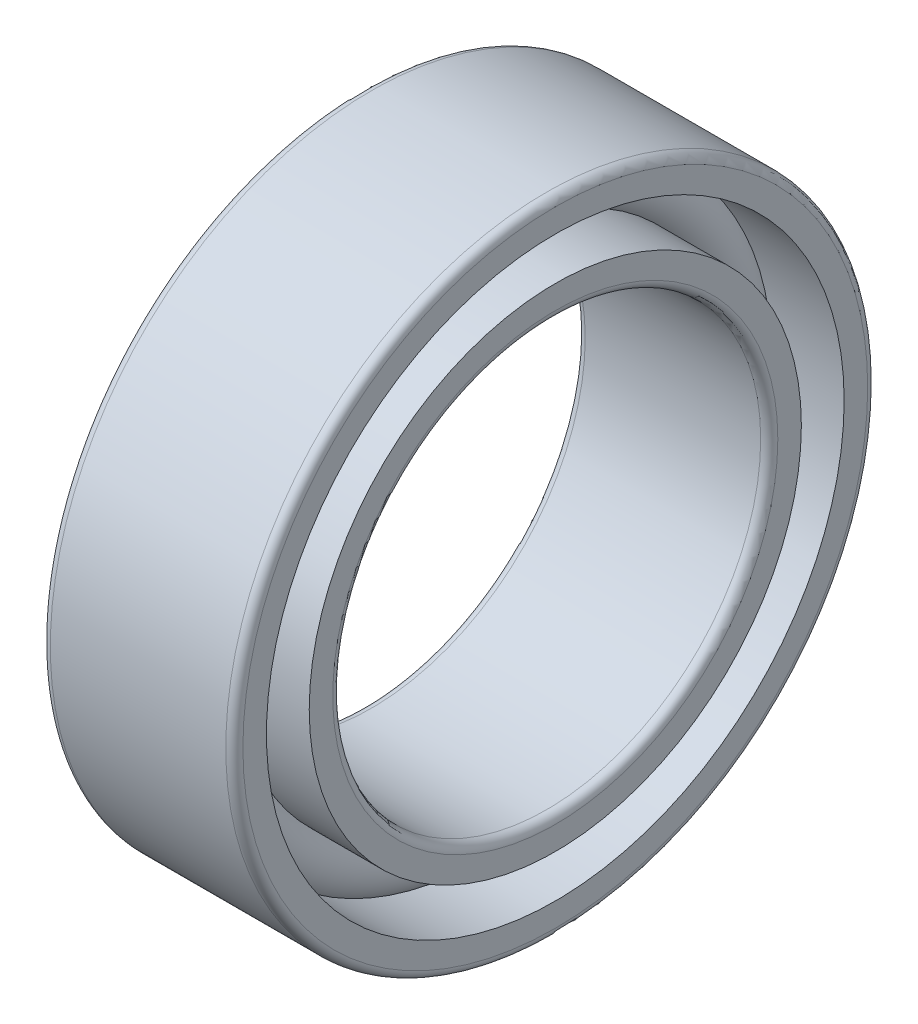
ISO-10303-21;
HEADER;
FILE_DESCRIPTION(('STEP AP214'),'2;1');
FILE_NAME('part.step','',(''),(''),'','','');
FILE_SCHEMA(('AUTOMOTIVE_DESIGN { 1 0 10303 214 1 1 1 1 }'));
ENDSEC;
DATA;
#1=APPLICATION_CONTEXT('core data for automotive mechanical design processes');
#2=APPLICATION_PROTOCOL_DEFINITION('international standard','automotive_design',2000,#1);
#3=PRODUCT_CONTEXT('',#1,'mechanical');
#4=PRODUCT('Part','Part','',(#3));
#5=PRODUCT_RELATED_PRODUCT_CATEGORY('part','',(#4));
#6=PRODUCT_DEFINITION_FORMATION('','',#4);
#7=PRODUCT_DEFINITION_CONTEXT('part definition',#1,'design');
#8=PRODUCT_DEFINITION('design','',#6,#7);
#9=PRODUCT_DEFINITION_SHAPE('','',#8);
#10=(LENGTH_UNIT() NAMED_UNIT(*) SI_UNIT(.MILLI.,.METRE.));
#11=(NAMED_UNIT(*) PLANE_ANGLE_UNIT() SI_UNIT($,.RADIAN.));
#12=(NAMED_UNIT(*) SI_UNIT($,.STERADIAN.) SOLID_ANGLE_UNIT());
#13=UNCERTAINTY_MEASURE_WITH_UNIT(LENGTH_MEASURE(1.E-05),#10,'distance_accuracy_value','');
#14=(GEOMETRIC_REPRESENTATION_CONTEXT(3) GLOBAL_UNCERTAINTY_ASSIGNED_CONTEXT((#13)) GLOBAL_UNIT_ASSIGNED_CONTEXT((#10,
#11,#12)) REPRESENTATION_CONTEXT('',''));
#15=CARTESIAN_POINT('',(0.,0.,0.));
#16=DIRECTION('',(0.,0.,1.));
#17=DIRECTION('',(1.,0.,0.));
#18=AXIS2_PLACEMENT_3D('',#15,#16,#17);
#19=CARTESIAN_POINT('',(0.,0.,0.));
#20=DIRECTION('',(-1.,0.,0.));
#21=DIRECTION('',(0.,0.,1.));
#22=AXIS2_PLACEMENT_3D('',#19,#20,#21);
#23=TOROIDAL_SURFACE('',#22,6.25,0.75);
#24=CARTESIAN_POINT('',(0.559016994374944,0.,0.));
#25=DIRECTION('',(-1.,0.,0.));
#26=DIRECTION('',(0.,0.,1.));
#27=AXIS2_PLACEMENT_3D('',#24,#25,#26);
#28=CIRCLE('',#27,6.75);
#29=CARTESIAN_POINT('',(0.559016994374944,0.,6.75));
#30=VERTEX_POINT('',#29);
#31=EDGE_CURVE('E38',#30,#30,#28,.F.);
#32=ORIENTED_EDGE('',*,*,#31,.T.);
#33=EDGE_LOOP('',(#32));
#34=FACE_BOUND('',#33,.T.);
#35=CARTESIAN_POINT('',(0.559016994374947,0.,0.));
#36=DIRECTION('',(-1.,0.,0.));
#37=DIRECTION('',(0.,0.,1.));
#38=AXIS2_PLACEMENT_3D('',#35,#36,#37);
#39=CIRCLE('',#38,5.75);
#40=CARTESIAN_POINT('',(0.559016994374947,0.,5.75));
#41=VERTEX_POINT('',#40);
#42=EDGE_CURVE('E10',#41,#41,#39,.T.);
#43=ORIENTED_EDGE('',*,*,#42,.T.);
#44=EDGE_LOOP('',(#43));
#45=FACE_BOUND('',#44,.T.);
#46=ADVANCED_FACE('F34',(#34,#45),#23,.T.);
#47=CARTESIAN_POINT('',(-20.6375,0.,0.));
#48=DIRECTION('',(1.,0.,0.));
#49=DIRECTION('',(0.,0.,-1.));
#50=AXIS2_PLACEMENT_3D('',#47,#48,#49);
#51=CYLINDRICAL_SURFACE('',#50,5.75);
#52=CARTESIAN_POINT('',(2.25,0.,0.));
#53=DIRECTION('',(1.,0.,0.));
#54=DIRECTION('',(0.,0.,-1.));
#55=AXIS2_PLACEMENT_3D('',#52,#53,#54);
#56=CIRCLE('',#55,5.75);
#57=CARTESIAN_POINT('',(2.25,0.,-5.75));
#58=VERTEX_POINT('',#57);
#59=EDGE_CURVE('E47',#58,#58,#56,.T.);
#60=ORIENTED_EDGE('',*,*,#59,.F.);
#61=EDGE_LOOP('',(#60));
#62=FACE_BOUND('',#61,.T.);
#63=ORIENTED_EDGE('',*,*,#42,.F.);
#64=EDGE_LOOP('',(#63));
#65=FACE_BOUND('',#64,.T.);
#66=ADVANCED_FACE('F86',(#62,#65),#51,.T.);
#67=CARTESIAN_POINT('',(-20.6375,0.,0.));
#68=DIRECTION('',(1.,0.,0.));
#69=DIRECTION('',(0.,0.,-1.));
#70=AXIS2_PLACEMENT_3D('',#67,#68,#69);
#71=CYLINDRICAL_SURFACE('',#70,5.75);
#72=CARTESIAN_POINT('',(-2.25,0.,0.));
#73=DIRECTION('',(1.,0.,0.));
#74=DIRECTION('',(0.,0.,-1.));
#75=AXIS2_PLACEMENT_3D('',#72,#73,#74);
#76=CIRCLE('',#75,5.75);
#77=CARTESIAN_POINT('',(-2.25,0.,-5.75));
#78=VERTEX_POINT('',#77);
#79=EDGE_CURVE('E56',#78,#78,#76,.T.);
#80=ORIENTED_EDGE('',*,*,#79,.T.);
#81=EDGE_LOOP('',(#80));
#82=FACE_BOUND('',#81,.T.);
#83=CARTESIAN_POINT('',(-0.559016994374947,0.,0.));
#84=DIRECTION('',(1.,0.,0.));
#85=DIRECTION('',(0.,0.,-1.));
#86=AXIS2_PLACEMENT_3D('',#83,#84,#85);
#87=CIRCLE('',#86,5.75);
#88=CARTESIAN_POINT('',(-0.559016994374947,0.,-5.75));
#89=VERTEX_POINT('',#88);
#90=EDGE_CURVE('E42',#89,#89,#87,.T.);
#91=ORIENTED_EDGE('',*,*,#90,.F.);
#92=EDGE_LOOP('',(#91));
#93=FACE_BOUND('',#92,.T.);
#94=ADVANCED_FACE('F89',(#82,#93),#71,.T.);
#95=CARTESIAN_POINT('',(2.25,5.2,0.));
#96=DIRECTION('',(1.,0.,0.));
#97=DIRECTION('',(0.,0.,-1.));
#98=AXIS2_PLACEMENT_3D('',#95,#96,#97);
#99=PLANE('',#98);
#100=ORIENTED_EDGE('',*,*,#59,.T.);
#101=EDGE_LOOP('',(#100));
#102=FACE_BOUND('',#101,.T.);
#103=CARTESIAN_POINT('',(2.25,0.,0.));
#104=DIRECTION('',(1.,0.,0.));
#105=DIRECTION('',(0.,0.,-1.));
#106=AXIS2_PLACEMENT_3D('',#103,#104,#105);
#107=CIRCLE('',#106,5.2);
#108=CARTESIAN_POINT('',(2.25,0.,-5.2));
#109=VERTEX_POINT('',#108);
#110=EDGE_CURVE('E78',#109,#109,#107,.T.);
#111=ORIENTED_EDGE('',*,*,#110,.F.);
#112=EDGE_LOOP('',(#111));
#113=FACE_BOUND('',#112,.T.);
#114=ADVANCED_FACE('F83',(#102,#113),#99,.T.);
#115=CARTESIAN_POINT('',(2.05,0.,0.));
#116=DIRECTION('',(1.,0.,0.));
#117=DIRECTION('',(0.,0.,-1.));
#118=AXIS2_PLACEMENT_3D('',#115,#116,#117);
#119=TOROIDAL_SURFACE('',#118,5.2,0.2);
#120=ORIENTED_EDGE('',*,*,#110,.T.);
#121=EDGE_LOOP('',(#120));
#122=FACE_BOUND('',#121,.T.);
#123=CARTESIAN_POINT('',(2.05,0.,0.));
#124=DIRECTION('',(1.,0.,0.));
#125=DIRECTION('',(0.,0.,-1.));
#126=AXIS2_PLACEMENT_3D('',#123,#124,#125);
#127=CIRCLE('',#126,5.);
#128=CARTESIAN_POINT('',(2.05,0.,-5.));
#129=VERTEX_POINT('',#128);
#130=EDGE_CURVE('E75',#129,#129,#127,.T.);
#131=ORIENTED_EDGE('',*,*,#130,.F.);
#132=EDGE_LOOP('',(#131));
#133=FACE_BOUND('',#132,.T.);
#134=ADVANCED_FACE('F100',(#122,#133),#119,.T.);
#135=CARTESIAN_POINT('',(-20.6375,0.,0.));
#136=DIRECTION('',(1.,0.,0.));
#137=DIRECTION('',(0.,0.,-1.));
#138=AXIS2_PLACEMENT_3D('',#135,#136,#137);
#139=CYLINDRICAL_SURFACE('',#138,5.);
#140=ORIENTED_EDGE('',*,*,#130,.T.);
#141=EDGE_LOOP('',(#140));
#142=FACE_BOUND('',#141,.T.);
#143=CARTESIAN_POINT('',(-2.05,0.,0.));
#144=DIRECTION('',(1.,0.,0.));
#145=DIRECTION('',(0.,0.,-1.));
#146=AXIS2_PLACEMENT_3D('',#143,#144,#145);
#147=CIRCLE('',#146,5.);
#148=CARTESIAN_POINT('',(-2.05,0.,-5.));
#149=VERTEX_POINT('',#148);
#150=EDGE_CURVE('E72',#149,#149,#147,.T.);
#151=ORIENTED_EDGE('',*,*,#150,.F.);
#152=EDGE_LOOP('',(#151));
#153=FACE_BOUND('',#152,.T.);
#154=ADVANCED_FACE('F103',(#142,#153),#139,.F.);
#155=CARTESIAN_POINT('',(-2.05,0.,0.));
#156=DIRECTION('',(1.,0.,0.));
#157=DIRECTION('',(0.,0.,-1.));
#158=AXIS2_PLACEMENT_3D('',#155,#156,#157);
#159=TOROIDAL_SURFACE('',#158,5.2,0.2);
#160=ORIENTED_EDGE('',*,*,#150,.T.);
#161=EDGE_LOOP('',(#160));
#162=FACE_BOUND('',#161,.T.);
#163=CARTESIAN_POINT('',(-2.25,0.,0.));
#164=DIRECTION('',(1.,0.,0.));
#165=DIRECTION('',(0.,0.,-1.));
#166=AXIS2_PLACEMENT_3D('',#163,#164,#165);
#167=CIRCLE('',#166,5.2);
#168=CARTESIAN_POINT('',(-2.25,0.,-5.2));
#169=VERTEX_POINT('',#168);
#170=EDGE_CURVE('E69',#169,#169,#167,.T.);
#171=ORIENTED_EDGE('',*,*,#170,.F.);
#172=EDGE_LOOP('',(#171));
#173=FACE_BOUND('',#172,.T.);
#174=ADVANCED_FACE('F107',(#162,#173),#159,.T.);
#175=CARTESIAN_POINT('',(-2.25,5.75,0.));
#176=DIRECTION('',(-1.,0.,0.));
#177=DIRECTION('',(0.,0.,1.));
#178=AXIS2_PLACEMENT_3D('',#175,#176,#177);
#179=PLANE('',#178);
#180=ORIENTED_EDGE('',*,*,#170,.T.);
#181=EDGE_LOOP('',(#180));
#182=FACE_BOUND('',#181,.T.);
#183=ORIENTED_EDGE('',*,*,#79,.F.);
#184=EDGE_LOOP('',(#183));
#185=FACE_BOUND('',#184,.T.);
#186=ADVANCED_FACE('F111',(#182,#185),#179,.T.);
#187=CARTESIAN_POINT('',(-0.559016994374944,0.,0.));
#188=DIRECTION('',(1.,0.,0.));
#189=DIRECTION('',(0.,0.,-1.));
#190=AXIS2_PLACEMENT_3D('',#187,#188,#189);
#191=CIRCLE('',#190,6.75);
#192=CARTESIAN_POINT('',(-0.559016994374944,0.,-6.75));
#193=VERTEX_POINT('',#192);
#194=EDGE_CURVE('E50',#193,#193,#191,.F.);
#195=ORIENTED_EDGE('',*,*,#194,.T.);
#196=EDGE_LOOP('',(#195));
#197=FACE_BOUND('',#196,.T.);
#198=ORIENTED_EDGE('',*,*,#90,.T.);
#199=EDGE_LOOP('',(#198));
#200=FACE_BOUND('',#199,.T.);
#201=ADVANCED_FACE('F36',(#197,#200),#23,.T.);
#202=CARTESIAN_POINT('',(-20.6375,0.,0.));
#203=DIRECTION('',(1.,0.,0.));
#204=DIRECTION('',(0.,0.,-1.));
#205=AXIS2_PLACEMENT_3D('',#202,#203,#204);
#206=CYLINDRICAL_SURFACE('',#205,6.75);
#207=CARTESIAN_POINT('',(2.25,0.,0.));
#208=DIRECTION('',(1.,0.,0.));
#209=DIRECTION('',(0.,0.,-1.));
#210=AXIS2_PLACEMENT_3D('',#207,#208,#209);
#211=CIRCLE('',#210,6.75000000000001);
#212=CARTESIAN_POINT('',(2.25,0.,-6.75000000000001));
#213=VERTEX_POINT('',#212);
#214=EDGE_CURVE('E52',#213,#213,#211,.T.);
#215=ORIENTED_EDGE('',*,*,#214,.T.);
#216=EDGE_LOOP('',(#215));
#217=FACE_BOUND('',#216,.T.);
#218=ORIENTED_EDGE('',*,*,#31,.F.);
#219=EDGE_LOOP('',(#218));
#220=FACE_BOUND('',#219,.T.);
#221=ADVANCED_FACE('F116',(#217,#220),#206,.F.);
#222=CARTESIAN_POINT('',(-20.6375,0.,0.));
#223=DIRECTION('',(1.,0.,0.));
#224=DIRECTION('',(0.,0.,-1.));
#225=AXIS2_PLACEMENT_3D('',#222,#223,#224);
#226=CYLINDRICAL_SURFACE('',#225,6.75);
#227=CARTESIAN_POINT('',(-2.25,0.,0.));
#228=DIRECTION('',(1.,0.,0.));
#229=DIRECTION('',(0.,0.,-1.));
#230=AXIS2_PLACEMENT_3D('',#227,#228,#229);
#231=CIRCLE('',#230,6.75000000000001);
#232=CARTESIAN_POINT('',(-2.25,0.,-6.75000000000001));
#233=VERTEX_POINT('',#232);
#234=EDGE_CURVE('E147',#233,#233,#231,.T.);
#235=ORIENTED_EDGE('',*,*,#234,.F.);
#236=EDGE_LOOP('',(#235));
#237=FACE_BOUND('',#236,.T.);
#238=ORIENTED_EDGE('',*,*,#194,.F.);
#239=EDGE_LOOP('',(#238));
#240=FACE_BOUND('',#239,.T.);
#241=ADVANCED_FACE('F119',(#237,#240),#226,.F.);
#242=CARTESIAN_POINT('',(2.25,7.30000000000001,0.));
#243=DIRECTION('',(1.,0.,0.));
#244=DIRECTION('',(0.,0.,-1.));
#245=AXIS2_PLACEMENT_3D('',#242,#243,#244);
#246=PLANE('',#245);
#247=CARTESIAN_POINT('',(2.25,0.,0.));
#248=DIRECTION('',(1.,0.,0.));
#249=DIRECTION('',(0.,0.,-1.));
#250=AXIS2_PLACEMENT_3D('',#247,#248,#249);
#251=CIRCLE('',#250,7.30000000000001);
#252=CARTESIAN_POINT('',(2.25,0.,-7.30000000000001));
#253=VERTEX_POINT('',#252);
#254=EDGE_CURVE('E58',#253,#253,#251,.T.);
#255=ORIENTED_EDGE('',*,*,#254,.T.);
#256=EDGE_LOOP('',(#255));
#257=FACE_BOUND('',#256,.T.);
#258=ORIENTED_EDGE('',*,*,#214,.F.);
#259=EDGE_LOOP('',(#258));
#260=FACE_BOUND('',#259,.T.);
#261=ADVANCED_FACE('F120',(#257,#260),#246,.T.);
#262=CARTESIAN_POINT('',(2.05,0.,0.));
#263=DIRECTION('',(1.,0.,0.));
#264=DIRECTION('',(0.,0.,-1.));
#265=AXIS2_PLACEMENT_3D('',#262,#263,#264);
#266=TOROIDAL_SURFACE('',#265,7.30000000000001,0.2);
#267=CARTESIAN_POINT('',(2.05,0.,0.));
#268=DIRECTION('',(1.,0.,0.));
#269=DIRECTION('',(0.,0.,-1.));
#270=AXIS2_PLACEMENT_3D('',#267,#268,#269);
#271=CIRCLE('',#270,7.50000000000001);
#272=CARTESIAN_POINT('',(2.05,0.,-7.50000000000001));
#273=VERTEX_POINT('',#272);
#274=EDGE_CURVE('E63',#273,#273,#271,.T.);
#275=ORIENTED_EDGE('',*,*,#274,.T.);
#276=EDGE_LOOP('',(#275));
#277=FACE_BOUND('',#276,.T.);
#278=ORIENTED_EDGE('',*,*,#254,.F.);
#279=EDGE_LOOP('',(#278));
#280=FACE_BOUND('',#279,.T.);
#281=ADVANCED_FACE('F123',(#277,#280),#266,.T.);
#282=CARTESIAN_POINT('',(-20.6375,0.,0.));
#283=DIRECTION('',(1.,0.,0.));
#284=DIRECTION('',(0.,0.,-1.));
#285=AXIS2_PLACEMENT_3D('',#282,#283,#284);
#286=CYLINDRICAL_SURFACE('',#285,7.50000000000001);
#287=CARTESIAN_POINT('',(-2.05,0.,0.));
#288=DIRECTION('',(1.,0.,0.));
#289=DIRECTION('',(0.,0.,-1.));
#290=AXIS2_PLACEMENT_3D('',#287,#288,#289);
#291=CIRCLE('',#290,7.50000000000001);
#292=CARTESIAN_POINT('',(-2.05,0.,-7.50000000000001));
#293=VERTEX_POINT('',#292);
#294=EDGE_CURVE('E151',#293,#293,#291,.T.);
#295=ORIENTED_EDGE('',*,*,#294,.T.);
#296=EDGE_LOOP('',(#295));
#297=FACE_BOUND('',#296,.T.);
#298=ORIENTED_EDGE('',*,*,#274,.F.);
#299=EDGE_LOOP('',(#298));
#300=FACE_BOUND('',#299,.T.);
#301=ADVANCED_FACE('F127',(#297,#300),#286,.T.);
#302=CARTESIAN_POINT('',(-2.05,0.,0.));
#303=DIRECTION('',(1.,0.,0.));
#304=DIRECTION('',(0.,0.,-1.));
#305=AXIS2_PLACEMENT_3D('',#302,#303,#304);
#306=TOROIDAL_SURFACE('',#305,7.30000000000001,0.2);
#307=CARTESIAN_POINT('',(-2.25,0.,0.));
#308=DIRECTION('',(1.,0.,0.));
#309=DIRECTION('',(0.,0.,-1.));
#310=AXIS2_PLACEMENT_3D('',#307,#308,#309);
#311=CIRCLE('',#310,7.30000000000001);
#312=CARTESIAN_POINT('',(-2.25,0.,-7.30000000000001));
#313=VERTEX_POINT('',#312);
#314=EDGE_CURVE('E148',#313,#313,#311,.T.);
#315=ORIENTED_EDGE('',*,*,#314,.T.);
#316=EDGE_LOOP('',(#315));
#317=FACE_BOUND('',#316,.T.);
#318=ORIENTED_EDGE('',*,*,#294,.F.);
#319=EDGE_LOOP('',(#318));
#320=FACE_BOUND('',#319,.T.);
#321=ADVANCED_FACE('F131',(#317,#320),#306,.T.);
#322=CARTESIAN_POINT('',(-2.25,6.75000000000001,0.));
#323=DIRECTION('',(-1.,0.,0.));
#324=DIRECTION('',(0.,0.,1.));
#325=AXIS2_PLACEMENT_3D('',#322,#323,#324);
#326=PLANE('',#325);
#327=ORIENTED_EDGE('',*,*,#234,.T.);
#328=EDGE_LOOP('',(#327));
#329=FACE_BOUND('',#328,.T.);
#330=ORIENTED_EDGE('',*,*,#314,.F.);
#331=EDGE_LOOP('',(#330));
#332=FACE_BOUND('',#331,.T.);
#333=ADVANCED_FACE('F135',(#329,#332),#326,.T.);
#334=CLOSED_SHELL('',(#46,#66,#94,#114,#134,#154,#174,#186,#201,#221,#241,#261,#281,#301,#321,#333));
#335=MANIFOLD_SOLID_BREP('B2',#334);
#336=ADVANCED_BREP_SHAPE_REPRESENTATION('',(#18,#335),#14);
#337=SHAPE_DEFINITION_REPRESENTATION(#9,#336);
ENDSEC;
END-ISO-10303-21;
